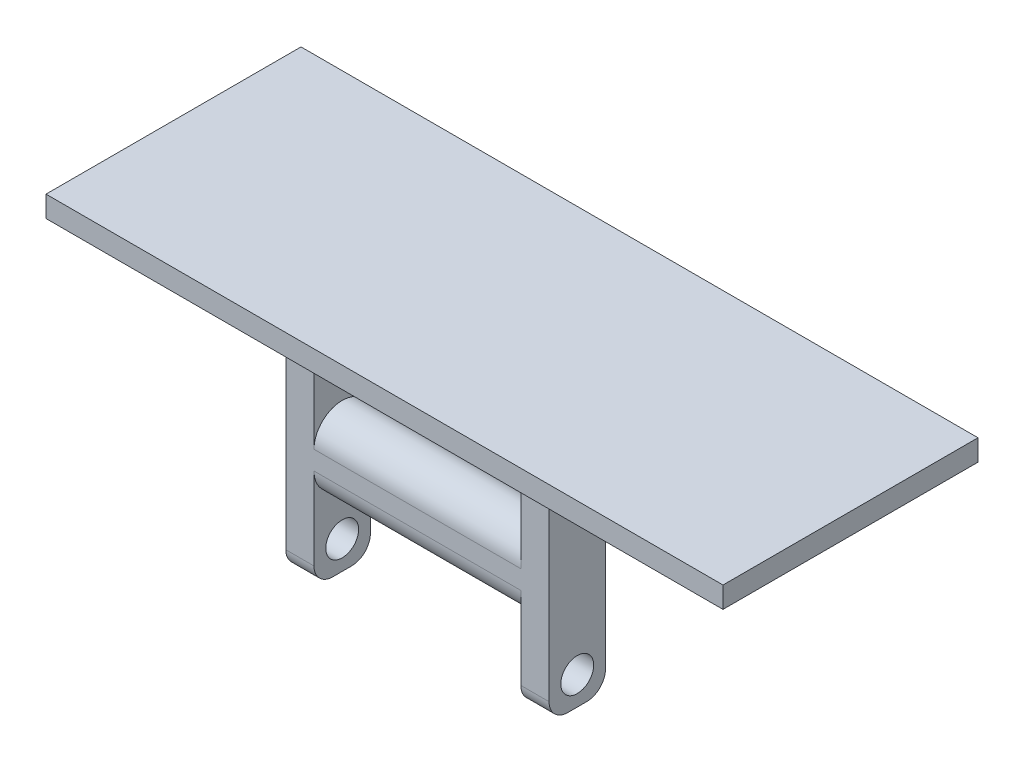
ISO-10303-21;
HEADER;
FILE_DESCRIPTION(('STEP AP214'),'2;1');
FILE_NAME('part.step','',(''),(''),'','','');
FILE_SCHEMA(('AUTOMOTIVE_DESIGN { 1 0 10303 214 1 1 1 1 }'));
ENDSEC;
DATA;
#1=APPLICATION_CONTEXT('core data for automotive mechanical design processes');
#2=APPLICATION_PROTOCOL_DEFINITION('international standard','automotive_design',2000,#1);
#3=PRODUCT_CONTEXT('',#1,'mechanical');
#4=PRODUCT('Part','Part','',(#3));
#5=PRODUCT_RELATED_PRODUCT_CATEGORY('part','',(#4));
#6=PRODUCT_DEFINITION_FORMATION('','',#4);
#7=PRODUCT_DEFINITION_CONTEXT('part definition',#1,'design');
#8=PRODUCT_DEFINITION('design','',#6,#7);
#9=PRODUCT_DEFINITION_SHAPE('','',#8);
#10=(LENGTH_UNIT() NAMED_UNIT(*) SI_UNIT(.MILLI.,.METRE.));
#11=(NAMED_UNIT(*) PLANE_ANGLE_UNIT() SI_UNIT($,.RADIAN.));
#12=(NAMED_UNIT(*) SI_UNIT($,.STERADIAN.) SOLID_ANGLE_UNIT());
#13=UNCERTAINTY_MEASURE_WITH_UNIT(LENGTH_MEASURE(1.E-05),#10,'distance_accuracy_value','');
#14=(GEOMETRIC_REPRESENTATION_CONTEXT(3) GLOBAL_UNCERTAINTY_ASSIGNED_CONTEXT((#13)) GLOBAL_UNIT_ASSIGNED_CONTEXT((#10,
#11,#12)) REPRESENTATION_CONTEXT('',''));
#15=CARTESIAN_POINT('',(0.,0.,0.));
#16=DIRECTION('',(0.,0.,1.));
#17=DIRECTION('',(1.,0.,0.));
#18=AXIS2_PLACEMENT_3D('',#15,#16,#17);
#19=CARTESIAN_POINT('',(14.,-1.,0.));
#20=DIRECTION('',(-1.,0.,0.));
#21=DIRECTION('',(0.,0.,1.));
#22=AXIS2_PLACEMENT_3D('',#19,#20,#21);
#23=CYLINDRICAL_SURFACE('',#22,3.);
#24=CARTESIAN_POINT('',(-11.,-1.,0.));
#25=DIRECTION('',(-1.,0.,0.));
#26=DIRECTION('',(0.,0.,1.));
#27=AXIS2_PLACEMENT_3D('',#24,#25,#26);
#28=CIRCLE('',#27,3.);
#29=CARTESIAN_POINT('',(-11.,-1.,-3.));
#30=VERTEX_POINT('',#29);
#31=CARTESIAN_POINT('',(-11.,-1.,3.));
#32=VERTEX_POINT('',#31);
#33=EDGE_CURVE('E249',#30,#32,#28,.T.);
#34=ORIENTED_EDGE('',*,*,#33,.F.);
#35=DIRECTION('',(-1.,0.,0.));
#36=VECTOR('',#35,1.);
#37=CARTESIAN_POINT('',(14.,-1.,-3.));
#38=LINE('',#37,#36);
#39=CARTESIAN_POINT('',(11.,-1.,-3.));
#40=VERTEX_POINT('',#39);
#41=EDGE_CURVE('E300',#40,#30,#38,.T.);
#42=ORIENTED_EDGE('',*,*,#41,.F.);
#43=CARTESIAN_POINT('',(11.,-1.,0.));
#44=DIRECTION('',(1.,0.,0.));
#45=DIRECTION('',(0.,0.,-1.));
#46=AXIS2_PLACEMENT_3D('',#43,#44,#45);
#47=CIRCLE('',#46,3.);
#48=CARTESIAN_POINT('',(11.,-1.,3.));
#49=VERTEX_POINT('',#48);
#50=EDGE_CURVE('E284',#49,#40,#47,.T.);
#51=ORIENTED_EDGE('',*,*,#50,.F.);
#52=DIRECTION('',(-1.,0.,0.));
#53=VECTOR('',#52,1.);
#54=CARTESIAN_POINT('',(14.,-1.,3.));
#55=LINE('',#54,#53);
#56=EDGE_CURVE('E292',#49,#32,#55,.T.);
#57=ORIENTED_EDGE('',*,*,#56,.T.);
#58=EDGE_LOOP('',(#34,#42,#51,#57));
#59=FACE_BOUND('',#58,.T.);
#60=ADVANCED_FACE('F33',(#59),#23,.T.);
#61=CARTESIAN_POINT('',(14.,1.,0.));
#62=DIRECTION('',(-1.,0.,0.));
#63=DIRECTION('',(0.,0.,1.));
#64=AXIS2_PLACEMENT_3D('',#61,#62,#63);
#65=CYLINDRICAL_SURFACE('',#64,3.);
#66=CARTESIAN_POINT('',(-11.,1.,0.));
#67=DIRECTION('',(-1.,0.,0.));
#68=DIRECTION('',(0.,0.,1.));
#69=AXIS2_PLACEMENT_3D('',#66,#67,#68);
#70=CIRCLE('',#69,3.);
#71=CARTESIAN_POINT('',(-11.,0.999999999999999,3.));
#72=VERTEX_POINT('',#71);
#73=CARTESIAN_POINT('',(-11.,1.,-3.));
#74=VERTEX_POINT('',#73);
#75=EDGE_CURVE('E245',#72,#74,#70,.T.);
#76=ORIENTED_EDGE('',*,*,#75,.F.);
#77=DIRECTION('',(-1.,0.,0.));
#78=VECTOR('',#77,1.);
#79=CARTESIAN_POINT('',(14.,0.999999999999999,3.));
#80=LINE('',#79,#78);
#81=CARTESIAN_POINT('',(11.,0.999999999999999,3.));
#82=VERTEX_POINT('',#81);
#83=EDGE_CURVE('E294',#82,#72,#80,.T.);
#84=ORIENTED_EDGE('',*,*,#83,.F.);
#85=CARTESIAN_POINT('',(11.,1.,0.));
#86=DIRECTION('',(1.,0.,0.));
#87=DIRECTION('',(0.,0.,-1.));
#88=AXIS2_PLACEMENT_3D('',#85,#86,#87);
#89=CIRCLE('',#88,3.);
#90=CARTESIAN_POINT('',(11.,1.,-3.));
#91=VERTEX_POINT('',#90);
#92=EDGE_CURVE('E279',#91,#82,#89,.T.);
#93=ORIENTED_EDGE('',*,*,#92,.F.);
#94=DIRECTION('',(-1.,0.,0.));
#95=VECTOR('',#94,1.);
#96=CARTESIAN_POINT('',(14.,1.,-3.));
#97=LINE('',#96,#95);
#98=EDGE_CURVE('E297',#91,#74,#97,.T.);
#99=ORIENTED_EDGE('',*,*,#98,.T.);
#100=EDGE_LOOP('',(#76,#84,#93,#99));
#101=FACE_BOUND('',#100,.T.);
#102=ADVANCED_FACE('F363',(#101),#65,.T.);
#103=CARTESIAN_POINT('',(14.,-1.,-3.));
#104=DIRECTION('',(0.,0.,1.));
#105=DIRECTION('',(0.,-1.,0.));
#106=AXIS2_PLACEMENT_3D('',#103,#104,#105);
#107=PLANE('',#106);
#108=DIRECTION('',(0.,1.,0.));
#109=VECTOR('',#108,1.);
#110=CARTESIAN_POINT('',(-14.,-1.,-3.));
#111=LINE('',#110,#109);
#112=CARTESIAN_POINT('',(-14.,-9.75,-3.));
#113=VERTEX_POINT('',#112);
#114=CARTESIAN_POINT('',(-14.,11.5,-3.));
#115=VERTEX_POINT('',#114);
#116=EDGE_CURVE('E254',#113,#115,#111,.T.);
#117=ORIENTED_EDGE('',*,*,#116,.T.);
#118=DIRECTION('',(1.,0.,0.));
#119=VECTOR('',#118,1.);
#120=CARTESIAN_POINT('',(14.,11.5,-3.));
#121=LINE('',#120,#119);
#122=CARTESIAN_POINT('',(-11.,11.5,-3.));
#123=VERTEX_POINT('',#122);
#124=EDGE_CURVE('E213',#115,#123,#121,.T.);
#125=ORIENTED_EDGE('',*,*,#124,.T.);
#126=DIRECTION('',(0.,1.,0.));
#127=VECTOR('',#126,1.);
#128=CARTESIAN_POINT('',(-11.,11.75,-3.));
#129=LINE('',#128,#127);
#130=EDGE_CURVE('E239',#74,#123,#129,.T.);
#131=ORIENTED_EDGE('',*,*,#130,.F.);
#132=ORIENTED_EDGE('',*,*,#98,.F.);
#133=DIRECTION('',(0.,1.,0.));
#134=VECTOR('',#133,1.);
#135=CARTESIAN_POINT('',(11.,11.75,-3.));
#136=LINE('',#135,#134);
#137=CARTESIAN_POINT('',(11.,11.5,-3.));
#138=VERTEX_POINT('',#137);
#139=EDGE_CURVE('E273',#91,#138,#136,.T.);
#140=ORIENTED_EDGE('',*,*,#139,.T.);
#141=CARTESIAN_POINT('',(14.,11.5,-3.));
#142=VERTEX_POINT('',#141);
#143=EDGE_CURVE('E48',#138,#142,#121,.T.);
#144=ORIENTED_EDGE('',*,*,#143,.T.);
#145=DIRECTION('',(0.,1.,0.));
#146=VECTOR('',#145,1.);
#147=CARTESIAN_POINT('',(14.,-1.,-3.));
#148=LINE('',#147,#146);
#149=CARTESIAN_POINT('',(14.,-9.75,-3.));
#150=VERTEX_POINT('',#149);
#151=EDGE_CURVE('E287',#150,#142,#148,.T.);
#152=ORIENTED_EDGE('',*,*,#151,.F.);
#153=DIRECTION('',(1.,0.,0.));
#154=VECTOR('',#153,1.);
#155=CARTESIAN_POINT('',(11.,-9.75,-3.));
#156=LINE('',#155,#154);
#157=CARTESIAN_POINT('',(11.,-9.75,-3.));
#158=VERTEX_POINT('',#157);
#159=EDGE_CURVE('E319',#150,#158,#156,.F.);
#160=ORIENTED_EDGE('',*,*,#159,.T.);
#161=EDGE_CURVE('E270',#158,#40,#136,.T.);
#162=ORIENTED_EDGE('',*,*,#161,.T.);
#163=ORIENTED_EDGE('',*,*,#41,.T.);
#164=CARTESIAN_POINT('',(-11.,-9.75,-3.));
#165=VERTEX_POINT('',#164);
#166=EDGE_CURVE('E236',#165,#30,#129,.T.);
#167=ORIENTED_EDGE('',*,*,#166,.F.);
#168=DIRECTION('',(-1.,0.,0.));
#169=VECTOR('',#168,1.);
#170=CARTESIAN_POINT('',(14.,-9.75,-3.));
#171=LINE('',#170,#169);
#172=EDGE_CURVE('E41',#165,#113,#171,.T.);
#173=ORIENTED_EDGE('',*,*,#172,.T.);
#174=EDGE_LOOP('',(#117,#125,#131,#132,#140,#144,#152,#160,#162,#163,#167,#173));
#175=FACE_BOUND('',#174,.T.);
#176=ADVANCED_FACE('F341',(#175),#107,.F.);
#177=CARTESIAN_POINT('',(14.,-1.,3.));
#178=DIRECTION('',(0.,0.,-1.));
#179=DIRECTION('',(0.,1.,0.));
#180=AXIS2_PLACEMENT_3D('',#177,#178,#179);
#181=PLANE('',#180);
#182=DIRECTION('',(0.,-1.,0.));
#183=VECTOR('',#182,1.);
#184=CARTESIAN_POINT('',(14.,-1.,3.));
#185=LINE('',#184,#183);
#186=CARTESIAN_POINT('',(14.,11.5,3.));
#187=VERTEX_POINT('',#186);
#188=CARTESIAN_POINT('',(14.,-9.75,3.));
#189=VERTEX_POINT('',#188);
#190=EDGE_CURVE('E290',#187,#189,#185,.T.);
#191=ORIENTED_EDGE('',*,*,#190,.F.);
#192=DIRECTION('',(-1.,0.,0.));
#193=VECTOR('',#192,1.);
#194=CARTESIAN_POINT('',(14.,11.5,3.));
#195=LINE('',#194,#193);
#196=CARTESIAN_POINT('',(11.,11.5,3.));
#197=VERTEX_POINT('',#196);
#198=EDGE_CURVE('E214',#187,#197,#195,.T.);
#199=ORIENTED_EDGE('',*,*,#198,.T.);
#200=DIRECTION('',(0.,-1.,0.));
#201=VECTOR('',#200,1.);
#202=CARTESIAN_POINT('',(11.,11.75,3.));
#203=LINE('',#202,#201);
#204=EDGE_CURVE('E274',#197,#82,#203,.T.);
#205=ORIENTED_EDGE('',*,*,#204,.T.);
#206=ORIENTED_EDGE('',*,*,#83,.T.);
#207=DIRECTION('',(0.,-1.,0.));
#208=VECTOR('',#207,1.);
#209=CARTESIAN_POINT('',(-11.,11.75,3.));
#210=LINE('',#209,#208);
#211=CARTESIAN_POINT('',(-11.,11.5,3.));
#212=VERTEX_POINT('',#211);
#213=EDGE_CURVE('E243',#212,#72,#210,.T.);
#214=ORIENTED_EDGE('',*,*,#213,.F.);
#215=CARTESIAN_POINT('',(-14.,11.5,3.));
#216=VERTEX_POINT('',#215);
#217=EDGE_CURVE('E56',#212,#216,#195,.T.);
#218=ORIENTED_EDGE('',*,*,#217,.T.);
#219=DIRECTION('',(0.,-1.,0.));
#220=VECTOR('',#219,1.);
#221=CARTESIAN_POINT('',(-14.,-1.,3.));
#222=LINE('',#221,#220);
#223=CARTESIAN_POINT('',(-14.,-9.75,3.));
#224=VERTEX_POINT('',#223);
#225=EDGE_CURVE('E252',#216,#224,#222,.T.);
#226=ORIENTED_EDGE('',*,*,#225,.T.);
#227=DIRECTION('',(-1.,0.,0.));
#228=VECTOR('',#227,1.);
#229=CARTESIAN_POINT('',(14.,-9.75,3.));
#230=LINE('',#229,#228);
#231=CARTESIAN_POINT('',(-11.,-9.75,3.));
#232=VERTEX_POINT('',#231);
#233=EDGE_CURVE('E331',#224,#232,#230,.F.);
#234=ORIENTED_EDGE('',*,*,#233,.T.);
#235=EDGE_CURVE('E242',#32,#232,#210,.T.);
#236=ORIENTED_EDGE('',*,*,#235,.F.);
#237=ORIENTED_EDGE('',*,*,#56,.F.);
#238=CARTESIAN_POINT('',(11.,-9.75,3.));
#239=VERTEX_POINT('',#238);
#240=EDGE_CURVE('E272',#49,#239,#203,.T.);
#241=ORIENTED_EDGE('',*,*,#240,.T.);
#242=DIRECTION('',(1.,0.,0.));
#243=VECTOR('',#242,1.);
#244=CARTESIAN_POINT('',(14.,-9.75,3.));
#245=LINE('',#244,#243);
#246=EDGE_CURVE('E303',#239,#189,#245,.T.);
#247=ORIENTED_EDGE('',*,*,#246,.T.);
#248=EDGE_LOOP('',(#191,#199,#205,#206,#214,#218,#226,#234,#236,#237,#241,#247));
#249=FACE_BOUND('',#248,.T.);
#250=ADVANCED_FACE('F355',(#249),#181,.F.);
#251=CARTESIAN_POINT('',(14.,-1.,0.));
#252=DIRECTION('',(1.,0.,0.));
#253=DIRECTION('',(0.,0.,-1.));
#254=AXIS2_PLACEMENT_3D('',#251,#252,#253);
#255=PLANE('',#254);
#256=DIRECTION('',(0.,0.,-1.));
#257=VECTOR('',#256,1.);
#258=CARTESIAN_POINT('',(14.,11.5,0.));
#259=LINE('',#258,#257);
#260=EDGE_CURVE('E221',#187,#142,#259,.T.);
#261=ORIENTED_EDGE('',*,*,#260,.F.);
#262=ORIENTED_EDGE('',*,*,#190,.T.);
#263=CARTESIAN_POINT('',(14.,-9.75,0.999999999999999));
#264=DIRECTION('',(1.,0.,0.));
#265=DIRECTION('',(0.,0.,-1.));
#266=AXIS2_PLACEMENT_3D('',#263,#264,#265);
#267=CIRCLE('',#266,2.);
#268=CARTESIAN_POINT('',(14.,-11.75,0.999999999999999));
#269=VERTEX_POINT('',#268);
#270=EDGE_CURVE('E308',#189,#269,#267,.T.);
#271=ORIENTED_EDGE('',*,*,#270,.T.);
#272=DIRECTION('',(0.,0.,-1.));
#273=VECTOR('',#272,1.);
#274=CARTESIAN_POINT('',(14.,-11.75,3.));
#275=LINE('',#274,#273);
#276=CARTESIAN_POINT('',(14.,-11.75,-1.));
#277=VERTEX_POINT('',#276);
#278=EDGE_CURVE('E267',#269,#277,#275,.T.);
#279=ORIENTED_EDGE('',*,*,#278,.T.);
#280=CARTESIAN_POINT('',(14.,-9.75,-1.));
#281=DIRECTION('',(1.,0.,0.));
#282=DIRECTION('',(0.,0.,-1.));
#283=AXIS2_PLACEMENT_3D('',#280,#281,#282);
#284=CIRCLE('',#283,2.);
#285=EDGE_CURVE('E306',#277,#150,#284,.T.);
#286=ORIENTED_EDGE('',*,*,#285,.T.);
#287=ORIENTED_EDGE('',*,*,#151,.T.);
#288=EDGE_LOOP('',(#261,#262,#271,#279,#286,#287));
#289=FACE_BOUND('',#288,.T.);
#290=CARTESIAN_POINT('',(14.,8.75,0.));
#291=DIRECTION('',(1.,0.,0.));
#292=DIRECTION('',(0.,0.,-1.));
#293=AXIS2_PLACEMENT_3D('',#290,#291,#292);
#294=CIRCLE('',#293,1.75);
#295=CARTESIAN_POINT('',(14.,8.75,-1.75));
#296=VERTEX_POINT('',#295);
#297=EDGE_CURVE('E257',#296,#296,#294,.T.);
#298=ORIENTED_EDGE('',*,*,#297,.F.);
#299=EDGE_LOOP('',(#298));
#300=FACE_BOUND('',#299,.T.);
#301=CARTESIAN_POINT('',(14.,-8.75,0.));
#302=DIRECTION('',(1.,0.,0.));
#303=DIRECTION('',(0.,0.,-1.));
#304=AXIS2_PLACEMENT_3D('',#301,#302,#303);
#305=CIRCLE('',#304,1.75);
#306=CARTESIAN_POINT('',(14.,-8.75,-1.75));
#307=VERTEX_POINT('',#306);
#308=EDGE_CURVE('E261',#307,#307,#305,.T.);
#309=ORIENTED_EDGE('',*,*,#308,.F.);
#310=EDGE_LOOP('',(#309));
#311=FACE_BOUND('',#310,.T.);
#312=ADVANCED_FACE('F377',(#289,#300,#311),#255,.T.);
#313=CARTESIAN_POINT('',(11.,8.75,0.));
#314=DIRECTION('',(1.,0.,0.));
#315=DIRECTION('',(0.,0.,-1.));
#316=AXIS2_PLACEMENT_3D('',#313,#314,#315);
#317=CYLINDRICAL_SURFACE('',#316,1.75);
#318=CARTESIAN_POINT('',(11.,8.75,0.));
#319=DIRECTION('',(1.,0.,0.));
#320=DIRECTION('',(0.,0.,-1.));
#321=AXIS2_PLACEMENT_3D('',#318,#319,#320);
#322=CIRCLE('',#321,1.75);
#323=CARTESIAN_POINT('',(11.,8.75,-1.75));
#324=VERTEX_POINT('',#323);
#325=EDGE_CURVE('E258',#324,#324,#322,.T.);
#326=ORIENTED_EDGE('',*,*,#325,.F.);
#327=EDGE_LOOP('',(#326));
#328=FACE_BOUND('',#327,.T.);
#329=ORIENTED_EDGE('',*,*,#297,.T.);
#330=EDGE_LOOP('',(#329));
#331=FACE_BOUND('',#330,.T.);
#332=ADVANCED_FACE('F445',(#328,#331),#317,.F.);
#333=CARTESIAN_POINT('',(11.,0.,0.));
#334=DIRECTION('',(1.,0.,0.));
#335=DIRECTION('',(0.,0.,-1.));
#336=AXIS2_PLACEMENT_3D('',#333,#334,#335);
#337=PLANE('',#336);
#338=ORIENTED_EDGE('',*,*,#325,.T.);
#339=EDGE_LOOP('',(#338));
#340=FACE_BOUND('',#339,.T.);
#341=ORIENTED_EDGE('',*,*,#204,.F.);
#342=DIRECTION('',(0.,0.,-1.));
#343=VECTOR('',#342,1.);
#344=CARTESIAN_POINT('',(11.,11.5,0.));
#345=LINE('',#344,#343);
#346=EDGE_CURVE('E219',#197,#138,#345,.T.);
#347=ORIENTED_EDGE('',*,*,#346,.T.);
#348=ORIENTED_EDGE('',*,*,#139,.F.);
#349=ORIENTED_EDGE('',*,*,#92,.T.);
#350=EDGE_LOOP('',(#341,#347,#348,#349));
#351=FACE_BOUND('',#350,.T.);
#352=ADVANCED_FACE('F370',(#340,#351),#337,.F.);
#353=CARTESIAN_POINT('',(11.,-8.75,0.));
#354=DIRECTION('',(1.,0.,0.));
#355=DIRECTION('',(0.,0.,-1.));
#356=AXIS2_PLACEMENT_3D('',#353,#354,#355);
#357=CIRCLE('',#356,1.75);
#358=CARTESIAN_POINT('',(11.,-8.75,-1.75));
#359=VERTEX_POINT('',#358);
#360=EDGE_CURVE('E264',#359,#359,#357,.T.);
#361=ORIENTED_EDGE('',*,*,#360,.T.);
#362=EDGE_LOOP('',(#361));
#363=FACE_BOUND('',#362,.T.);
#364=DIRECTION('',(0.,0.,-1.));
#365=VECTOR('',#364,1.);
#366=CARTESIAN_POINT('',(11.,-11.75,3.));
#367=LINE('',#366,#365);
#368=CARTESIAN_POINT('',(11.,-11.75,0.999999999999999));
#369=VERTEX_POINT('',#368);
#370=CARTESIAN_POINT('',(11.,-11.75,-1.));
#371=VERTEX_POINT('',#370);
#372=EDGE_CURVE('E276',#369,#371,#367,.T.);
#373=ORIENTED_EDGE('',*,*,#372,.F.);
#374=CARTESIAN_POINT('',(11.,-9.75,0.999999999999999));
#375=DIRECTION('',(1.,0.,0.));
#376=DIRECTION('',(0.,0.,-1.));
#377=AXIS2_PLACEMENT_3D('',#374,#375,#376);
#378=CIRCLE('',#377,2.);
#379=EDGE_CURVE('E317',#369,#239,#378,.F.);
#380=ORIENTED_EDGE('',*,*,#379,.T.);
#381=ORIENTED_EDGE('',*,*,#240,.F.);
#382=ORIENTED_EDGE('',*,*,#50,.T.);
#383=ORIENTED_EDGE('',*,*,#161,.F.);
#384=CARTESIAN_POINT('',(11.,-9.75,-1.));
#385=DIRECTION('',(1.,0.,0.));
#386=DIRECTION('',(0.,0.,-1.));
#387=AXIS2_PLACEMENT_3D('',#384,#385,#386);
#388=CIRCLE('',#387,2.);
#389=EDGE_CURVE('E315',#158,#371,#388,.F.);
#390=ORIENTED_EDGE('',*,*,#389,.T.);
#391=EDGE_LOOP('',(#373,#380,#381,#382,#383,#390));
#392=FACE_BOUND('',#391,.T.);
#393=ADVANCED_FACE('F389',(#363,#392),#337,.F.);
#394=CARTESIAN_POINT('',(11.,-11.75,3.));
#395=DIRECTION('',(0.,-1.,0.));
#396=DIRECTION('',(0.,0.,-1.));
#397=AXIS2_PLACEMENT_3D('',#394,#395,#396);
#398=PLANE('',#397);
#399=ORIENTED_EDGE('',*,*,#278,.F.);
#400=DIRECTION('',(1.,0.,0.));
#401=VECTOR('',#400,1.);
#402=CARTESIAN_POINT('',(11.,-11.75,0.999999999999999));
#403=LINE('',#402,#401);
#404=EDGE_CURVE('E313',#269,#369,#403,.F.);
#405=ORIENTED_EDGE('',*,*,#404,.T.);
#406=ORIENTED_EDGE('',*,*,#372,.T.);
#407=DIRECTION('',(1.,0.,0.));
#408=VECTOR('',#407,1.);
#409=CARTESIAN_POINT('',(14.,-11.75,-1.));
#410=LINE('',#409,#408);
#411=EDGE_CURVE('E310',#371,#277,#410,.T.);
#412=ORIENTED_EDGE('',*,*,#411,.T.);
#413=EDGE_LOOP('',(#399,#405,#406,#412));
#414=FACE_BOUND('',#413,.T.);
#415=ADVANCED_FACE('F386',(#414),#398,.T.);
#416=CARTESIAN_POINT('',(11.,-8.75,0.));
#417=DIRECTION('',(1.,0.,0.));
#418=DIRECTION('',(0.,0.,-1.));
#419=AXIS2_PLACEMENT_3D('',#416,#417,#418);
#420=CYLINDRICAL_SURFACE('',#419,1.75);
#421=ORIENTED_EDGE('',*,*,#360,.F.);
#422=EDGE_LOOP('',(#421));
#423=FACE_BOUND('',#422,.T.);
#424=ORIENTED_EDGE('',*,*,#308,.T.);
#425=EDGE_LOOP('',(#424));
#426=FACE_BOUND('',#425,.T.);
#427=ADVANCED_FACE('F430',(#423,#426),#420,.F.);
#428=CARTESIAN_POINT('',(14.,-9.75,0.999999999999999));
#429=DIRECTION('',(-1.,0.,0.));
#430=DIRECTION('',(0.,0.,1.));
#431=AXIS2_PLACEMENT_3D('',#428,#429,#430);
#432=CYLINDRICAL_SURFACE('',#431,2.);
#433=ORIENTED_EDGE('',*,*,#379,.F.);
#434=ORIENTED_EDGE('',*,*,#404,.F.);
#435=ORIENTED_EDGE('',*,*,#270,.F.);
#436=ORIENTED_EDGE('',*,*,#246,.F.);
#437=EDGE_LOOP('',(#433,#434,#435,#436));
#438=FACE_BOUND('',#437,.T.);
#439=ADVANCED_FACE('F383',(#438),#432,.T.);
#440=CARTESIAN_POINT('',(11.,-9.75,-1.));
#441=DIRECTION('',(-1.,0.,0.));
#442=DIRECTION('',(0.,0.,1.));
#443=AXIS2_PLACEMENT_3D('',#440,#441,#442);
#444=CYLINDRICAL_SURFACE('',#443,2.);
#445=ORIENTED_EDGE('',*,*,#389,.F.);
#446=ORIENTED_EDGE('',*,*,#159,.F.);
#447=ORIENTED_EDGE('',*,*,#285,.F.);
#448=ORIENTED_EDGE('',*,*,#411,.F.);
#449=EDGE_LOOP('',(#445,#446,#447,#448));
#450=FACE_BOUND('',#449,.T.);
#451=ADVANCED_FACE('F394',(#450),#444,.T.);
#452=CARTESIAN_POINT('',(-14.,-1.,0.));
#453=DIRECTION('',(-1.,0.,0.));
#454=DIRECTION('',(0.,0.,-1.));
#455=AXIS2_PLACEMENT_3D('',#452,#453,#454);
#456=PLANE('',#455);
#457=DIRECTION('',(0.,0.,1.));
#458=VECTOR('',#457,1.);
#459=CARTESIAN_POINT('',(-14.,11.5,0.));
#460=LINE('',#459,#458);
#461=EDGE_CURVE('E217',#115,#216,#460,.T.);
#462=ORIENTED_EDGE('',*,*,#461,.F.);
#463=ORIENTED_EDGE('',*,*,#116,.F.);
#464=CARTESIAN_POINT('',(-14.,-9.75,-1.));
#465=DIRECTION('',(-1.,0.,0.));
#466=DIRECTION('',(0.,0.,1.));
#467=AXIS2_PLACEMENT_3D('',#464,#465,#466);
#468=CIRCLE('',#467,2.);
#469=CARTESIAN_POINT('',(-14.,-11.75,-1.));
#470=VERTEX_POINT('',#469);
#471=EDGE_CURVE('E326',#113,#470,#468,.T.);
#472=ORIENTED_EDGE('',*,*,#471,.T.);
#473=DIRECTION('',(0.,0.,-1.));
#474=VECTOR('',#473,1.);
#475=CARTESIAN_POINT('',(-14.,-11.75,3.));
#476=LINE('',#475,#474);
#477=CARTESIAN_POINT('',(-14.,-11.75,0.999999999999999));
#478=VERTEX_POINT('',#477);
#479=EDGE_CURVE('E233',#478,#470,#476,.T.);
#480=ORIENTED_EDGE('',*,*,#479,.F.);
#481=CARTESIAN_POINT('',(-14.,-9.75,0.999999999999999));
#482=DIRECTION('',(-1.,0.,0.));
#483=DIRECTION('',(0.,0.,1.));
#484=AXIS2_PLACEMENT_3D('',#481,#482,#483);
#485=CIRCLE('',#484,2.);
#486=EDGE_CURVE('E328',#478,#224,#485,.T.);
#487=ORIENTED_EDGE('',*,*,#486,.T.);
#488=ORIENTED_EDGE('',*,*,#225,.F.);
#489=EDGE_LOOP('',(#462,#463,#472,#480,#487,#488));
#490=FACE_BOUND('',#489,.T.);
#491=CARTESIAN_POINT('',(-14.,8.75,0.));
#492=DIRECTION('',(1.,0.,0.));
#493=DIRECTION('',(0.,0.,-1.));
#494=AXIS2_PLACEMENT_3D('',#491,#492,#493);
#495=CIRCLE('',#494,1.75);
#496=CARTESIAN_POINT('',(-14.,8.75,-1.75));
#497=VERTEX_POINT('',#496);
#498=EDGE_CURVE('E223',#497,#497,#495,.T.);
#499=ORIENTED_EDGE('',*,*,#498,.T.);
#500=EDGE_LOOP('',(#499));
#501=FACE_BOUND('',#500,.T.);
#502=CARTESIAN_POINT('',(-14.,-8.75,0.));
#503=DIRECTION('',(1.,0.,0.));
#504=DIRECTION('',(0.,0.,-1.));
#505=AXIS2_PLACEMENT_3D('',#502,#503,#504);
#506=CIRCLE('',#505,1.75);
#507=CARTESIAN_POINT('',(-14.,-8.75,-1.75));
#508=VERTEX_POINT('',#507);
#509=EDGE_CURVE('E227',#508,#508,#506,.T.);
#510=ORIENTED_EDGE('',*,*,#509,.T.);
#511=EDGE_LOOP('',(#510));
#512=FACE_BOUND('',#511,.T.);
#513=ADVANCED_FACE('F346',(#490,#501,#512),#456,.T.);
#514=CARTESIAN_POINT('',(-11.,8.75,0.));
#515=DIRECTION('',(-1.,0.,0.));
#516=DIRECTION('',(0.,0.,1.));
#517=AXIS2_PLACEMENT_3D('',#514,#515,#516);
#518=CYLINDRICAL_SURFACE('',#517,1.75);
#519=CARTESIAN_POINT('',(-11.,8.75,0.));
#520=DIRECTION('',(1.,0.,0.));
#521=DIRECTION('',(0.,0.,-1.));
#522=AXIS2_PLACEMENT_3D('',#519,#520,#521);
#523=CIRCLE('',#522,1.75);
#524=CARTESIAN_POINT('',(-11.,8.75,-1.75));
#525=VERTEX_POINT('',#524);
#526=EDGE_CURVE('E224',#525,#525,#523,.T.);
#527=ORIENTED_EDGE('',*,*,#526,.T.);
#528=EDGE_LOOP('',(#527));
#529=FACE_BOUND('',#528,.T.);
#530=ORIENTED_EDGE('',*,*,#498,.F.);
#531=EDGE_LOOP('',(#530));
#532=FACE_BOUND('',#531,.T.);
#533=ADVANCED_FACE('F435',(#529,#532),#518,.F.);
#534=CARTESIAN_POINT('',(-11.,0.,0.));
#535=DIRECTION('',(-1.,0.,0.));
#536=DIRECTION('',(0.,0.,-1.));
#537=AXIS2_PLACEMENT_3D('',#534,#535,#536);
#538=PLANE('',#537);
#539=ORIENTED_EDGE('',*,*,#526,.F.);
#540=EDGE_LOOP('',(#539));
#541=FACE_BOUND('',#540,.T.);
#542=ORIENTED_EDGE('',*,*,#130,.T.);
#543=DIRECTION('',(0.,0.,1.));
#544=VECTOR('',#543,1.);
#545=CARTESIAN_POINT('',(-11.,11.5,0.));
#546=LINE('',#545,#544);
#547=EDGE_CURVE('E11',#123,#212,#546,.T.);
#548=ORIENTED_EDGE('',*,*,#547,.T.);
#549=ORIENTED_EDGE('',*,*,#213,.T.);
#550=ORIENTED_EDGE('',*,*,#75,.T.);
#551=EDGE_LOOP('',(#542,#548,#549,#550));
#552=FACE_BOUND('',#551,.T.);
#553=ADVANCED_FACE('F360',(#541,#552),#538,.F.);
#554=CARTESIAN_POINT('',(-11.,-8.75,0.));
#555=DIRECTION('',(1.,0.,0.));
#556=DIRECTION('',(0.,0.,-1.));
#557=AXIS2_PLACEMENT_3D('',#554,#555,#556);
#558=CIRCLE('',#557,1.75);
#559=CARTESIAN_POINT('',(-11.,-8.75,-1.75));
#560=VERTEX_POINT('',#559);
#561=EDGE_CURVE('E230',#560,#560,#558,.T.);
#562=ORIENTED_EDGE('',*,*,#561,.F.);
#563=EDGE_LOOP('',(#562));
#564=FACE_BOUND('',#563,.T.);
#565=ORIENTED_EDGE('',*,*,#235,.T.);
#566=CARTESIAN_POINT('',(-11.,-9.75,0.999999999999999));
#567=DIRECTION('',(-1.,0.,0.));
#568=DIRECTION('',(0.,0.,1.));
#569=AXIS2_PLACEMENT_3D('',#566,#567,#568);
#570=CIRCLE('',#569,2.);
#571=CARTESIAN_POINT('',(-11.,-11.75,0.999999999999999));
#572=VERTEX_POINT('',#571);
#573=EDGE_CURVE('E335',#232,#572,#570,.F.);
#574=ORIENTED_EDGE('',*,*,#573,.T.);
#575=DIRECTION('',(0.,0.,-1.));
#576=VECTOR('',#575,1.);
#577=CARTESIAN_POINT('',(-11.,-11.75,3.));
#578=LINE('',#577,#576);
#579=CARTESIAN_POINT('',(-11.,-11.75,-1.));
#580=VERTEX_POINT('',#579);
#581=EDGE_CURVE('E238',#572,#580,#578,.T.);
#582=ORIENTED_EDGE('',*,*,#581,.T.);
#583=CARTESIAN_POINT('',(-11.,-9.75,-1.));
#584=DIRECTION('',(-1.,0.,0.));
#585=DIRECTION('',(0.,0.,1.));
#586=AXIS2_PLACEMENT_3D('',#583,#584,#585);
#587=CIRCLE('',#586,2.);
#588=EDGE_CURVE('E333',#580,#165,#587,.F.);
#589=ORIENTED_EDGE('',*,*,#588,.T.);
#590=ORIENTED_EDGE('',*,*,#166,.T.);
#591=ORIENTED_EDGE('',*,*,#33,.T.);
#592=EDGE_LOOP('',(#565,#574,#582,#589,#590,#591));
#593=FACE_BOUND('',#592,.T.);
#594=ADVANCED_FACE('F403',(#564,#593),#538,.F.);
#595=CARTESIAN_POINT('',(-11.,-11.75,3.));
#596=DIRECTION('',(0.,1.,0.));
#597=DIRECTION('',(0.,0.,1.));
#598=AXIS2_PLACEMENT_3D('',#595,#596,#597);
#599=PLANE('',#598);
#600=ORIENTED_EDGE('',*,*,#581,.F.);
#601=DIRECTION('',(-1.,0.,0.));
#602=VECTOR('',#601,1.);
#603=CARTESIAN_POINT('',(-11.,-11.75,0.999999999999999));
#604=LINE('',#603,#602);
#605=EDGE_CURVE('E323',#572,#478,#604,.T.);
#606=ORIENTED_EDGE('',*,*,#605,.T.);
#607=ORIENTED_EDGE('',*,*,#479,.T.);
#608=DIRECTION('',(-1.,0.,0.));
#609=VECTOR('',#608,1.);
#610=CARTESIAN_POINT('',(-11.,-11.75,-1.));
#611=LINE('',#610,#609);
#612=EDGE_CURVE('E321',#470,#580,#611,.F.);
#613=ORIENTED_EDGE('',*,*,#612,.T.);
#614=EDGE_LOOP('',(#600,#606,#607,#613));
#615=FACE_BOUND('',#614,.T.);
#616=ADVANCED_FACE('F411',(#615),#599,.F.);
#617=CARTESIAN_POINT('',(-11.,-8.75,0.));
#618=DIRECTION('',(-1.,0.,0.));
#619=DIRECTION('',(0.,0.,1.));
#620=AXIS2_PLACEMENT_3D('',#617,#618,#619);
#621=CYLINDRICAL_SURFACE('',#620,1.75);
#622=ORIENTED_EDGE('',*,*,#561,.T.);
#623=EDGE_LOOP('',(#622));
#624=FACE_BOUND('',#623,.T.);
#625=ORIENTED_EDGE('',*,*,#509,.F.);
#626=EDGE_LOOP('',(#625));
#627=FACE_BOUND('',#626,.T.);
#628=ADVANCED_FACE('F419',(#624,#627),#621,.F.);
#629=CARTESIAN_POINT('',(-11.,-9.75,0.999999999999999));
#630=DIRECTION('',(-1.,0.,0.));
#631=DIRECTION('',(0.,0.,1.));
#632=AXIS2_PLACEMENT_3D('',#629,#630,#631);
#633=CYLINDRICAL_SURFACE('',#632,2.);
#634=ORIENTED_EDGE('',*,*,#573,.F.);
#635=ORIENTED_EDGE('',*,*,#233,.F.);
#636=ORIENTED_EDGE('',*,*,#486,.F.);
#637=ORIENTED_EDGE('',*,*,#605,.F.);
#638=EDGE_LOOP('',(#634,#635,#636,#637));
#639=FACE_BOUND('',#638,.T.);
#640=ADVANCED_FACE('F407',(#639),#633,.T.);
#641=CARTESIAN_POINT('',(14.,-9.75,-1.));
#642=DIRECTION('',(-1.,0.,0.));
#643=DIRECTION('',(0.,0.,1.));
#644=AXIS2_PLACEMENT_3D('',#641,#642,#643);
#645=CYLINDRICAL_SURFACE('',#644,2.);
#646=ORIENTED_EDGE('',*,*,#588,.F.);
#647=ORIENTED_EDGE('',*,*,#612,.F.);
#648=ORIENTED_EDGE('',*,*,#471,.F.);
#649=ORIENTED_EDGE('',*,*,#172,.F.);
#650=EDGE_LOOP('',(#646,#647,#648,#649));
#651=FACE_BOUND('',#650,.T.);
#652=ADVANCED_FACE('F35',(#651),#645,.T.);
#653=CARTESIAN_POINT('',(-36.,11.5,6.49999999999999));
#654=DIRECTION('',(0.,-1.,0.));
#655=DIRECTION('',(1.,0.,0.));
#656=AXIS2_PLACEMENT_3D('',#653,#654,#655);
#657=PLANE('',#656);
#658=ORIENTED_EDGE('',*,*,#198,.F.);
#659=ORIENTED_EDGE('',*,*,#260,.T.);
#660=ORIENTED_EDGE('',*,*,#143,.F.);
#661=ORIENTED_EDGE('',*,*,#346,.F.);
#662=EDGE_LOOP('',(#658,#659,#660,#661));
#663=FACE_BOUND('',#662,.T.);
#664=ORIENTED_EDGE('',*,*,#124,.F.);
#665=ORIENTED_EDGE('',*,*,#461,.T.);
#666=ORIENTED_EDGE('',*,*,#217,.F.);
#667=ORIENTED_EDGE('',*,*,#547,.F.);
#668=EDGE_LOOP('',(#664,#665,#666,#667));
#669=FACE_BOUND('',#668,.T.);
#670=DIRECTION('',(0.,0.,1.));
#671=VECTOR('',#670,1.);
#672=CARTESIAN_POINT('',(-36.,11.5,6.49999999999999));
#673=LINE('',#672,#671);
#674=CARTESIAN_POINT('',(-36.,11.5,-20.6198957893482));
#675=VERTEX_POINT('',#674);
#676=CARTESIAN_POINT('',(-36.,11.5,6.49999999999999));
#677=VERTEX_POINT('',#676);
#678=EDGE_CURVE('E176',#675,#677,#673,.T.);
#679=ORIENTED_EDGE('',*,*,#678,.F.);
#680=DIRECTION('',(-1.,0.,0.));
#681=VECTOR('',#680,1.);
#682=CARTESIAN_POINT('',(-36.,11.5,-20.6198957893482));
#683=LINE('',#682,#681);
#684=CARTESIAN_POINT('',(36.,11.5,-20.6198957893482));
#685=VERTEX_POINT('',#684);
#686=EDGE_CURVE('E202',#685,#675,#683,.T.);
#687=ORIENTED_EDGE('',*,*,#686,.F.);
#688=DIRECTION('',(0.,0.,-1.));
#689=VECTOR('',#688,1.);
#690=CARTESIAN_POINT('',(36.,11.5,6.49999999999999));
#691=LINE('',#690,#689);
#692=CARTESIAN_POINT('',(36.,11.5,6.49999999999999));
#693=VERTEX_POINT('',#692);
#694=EDGE_CURVE('E206',#693,#685,#691,.T.);
#695=ORIENTED_EDGE('',*,*,#694,.F.);
#696=DIRECTION('',(1.,0.,0.));
#697=VECTOR('',#696,1.);
#698=CARTESIAN_POINT('',(-36.,11.5,6.49999999999999));
#699=LINE('',#698,#697);
#700=EDGE_CURVE('E198',#677,#693,#699,.T.);
#701=ORIENTED_EDGE('',*,*,#700,.F.);
#702=EDGE_LOOP('',(#679,#687,#695,#701));
#703=FACE_BOUND('',#702,.T.);
#704=ADVANCED_FACE('F350',(#663,#669,#703),#657,.T.);
#705=CARTESIAN_POINT('',(-36.,-65.4382138317826,6.49999999999999));
#706=DIRECTION('',(0.,0.,1.));
#707=DIRECTION('',(1.,0.,0.));
#708=AXIS2_PLACEMENT_3D('',#705,#706,#707);
#709=PLANE('',#708);
#710=DIRECTION('',(0.,1.,0.));
#711=VECTOR('',#710,1.);
#712=CARTESIAN_POINT('',(-36.,-65.4382138317826,6.49999999999999));
#713=LINE('',#712,#711);
#714=CARTESIAN_POINT('',(-36.,13.75,6.49999999999999));
#715=VERTEX_POINT('',#714);
#716=EDGE_CURVE('E170',#677,#715,#713,.T.);
#717=ORIENTED_EDGE('',*,*,#716,.F.);
#718=ORIENTED_EDGE('',*,*,#700,.T.);
#719=DIRECTION('',(0.,1.,0.));
#720=VECTOR('',#719,1.);
#721=CARTESIAN_POINT('',(36.,-65.4382138317826,6.49999999999999));
#722=LINE('',#721,#720);
#723=CARTESIAN_POINT('',(36.,13.75,6.49999999999999));
#724=VERTEX_POINT('',#723);
#725=EDGE_CURVE('E184',#693,#724,#722,.T.);
#726=ORIENTED_EDGE('',*,*,#725,.T.);
#727=DIRECTION('',(1.,0.,0.));
#728=VECTOR('',#727,1.);
#729=CARTESIAN_POINT('',(-36.,13.75,6.49999999999999));
#730=LINE('',#729,#728);
#731=EDGE_CURVE('E181',#715,#724,#730,.T.);
#732=ORIENTED_EDGE('',*,*,#731,.F.);
#733=EDGE_LOOP('',(#717,#718,#726,#732));
#734=FACE_BOUND('',#733,.T.);
#735=ADVANCED_FACE('F182',(#734),#709,.T.);
#736=CARTESIAN_POINT('',(36.,-65.4382138317826,6.49999999999999));
#737=DIRECTION('',(1.,0.,0.));
#738=DIRECTION('',(0.,0.,-1.));
#739=AXIS2_PLACEMENT_3D('',#736,#737,#738);
#740=PLANE('',#739);
#741=ORIENTED_EDGE('',*,*,#725,.F.);
#742=ORIENTED_EDGE('',*,*,#694,.T.);
#743=DIRECTION('',(0.,1.,0.));
#744=VECTOR('',#743,1.);
#745=CARTESIAN_POINT('',(36.,-65.4382138317826,-20.6198957893482));
#746=LINE('',#745,#744);
#747=CARTESIAN_POINT('',(36.,13.75,-20.6198957893482));
#748=VERTEX_POINT('',#747);
#749=EDGE_CURVE('E205',#685,#748,#746,.T.);
#750=ORIENTED_EDGE('',*,*,#749,.T.);
#751=DIRECTION('',(0.,0.,-1.));
#752=VECTOR('',#751,1.);
#753=CARTESIAN_POINT('',(36.,13.75,6.49999999999999));
#754=LINE('',#753,#752);
#755=EDGE_CURVE('E188',#724,#748,#754,.T.);
#756=ORIENTED_EDGE('',*,*,#755,.F.);
#757=EDGE_LOOP('',(#741,#742,#750,#756));
#758=FACE_BOUND('',#757,.T.);
#759=ADVANCED_FACE('F532',(#758),#740,.T.);
#760=CARTESIAN_POINT('',(-36.,-65.4382138317826,-20.6198957893482));
#761=DIRECTION('',(0.,0.,-1.));
#762=DIRECTION('',(-1.,0.,0.));
#763=AXIS2_PLACEMENT_3D('',#760,#761,#762);
#764=PLANE('',#763);
#765=ORIENTED_EDGE('',*,*,#749,.F.);
#766=ORIENTED_EDGE('',*,*,#686,.T.);
#767=DIRECTION('',(0.,1.,0.));
#768=VECTOR('',#767,1.);
#769=CARTESIAN_POINT('',(-36.,-65.4382138317826,-20.6198957893482));
#770=LINE('',#769,#768);
#771=CARTESIAN_POINT('',(-36.,13.75,-20.6198957893482));
#772=VERTEX_POINT('',#771);
#773=EDGE_CURVE('E201',#675,#772,#770,.T.);
#774=ORIENTED_EDGE('',*,*,#773,.T.);
#775=DIRECTION('',(-1.,0.,0.));
#776=VECTOR('',#775,1.);
#777=CARTESIAN_POINT('',(-36.,13.75,-20.6198957893482));
#778=LINE('',#777,#776);
#779=EDGE_CURVE('E193',#748,#772,#778,.T.);
#780=ORIENTED_EDGE('',*,*,#779,.F.);
#781=EDGE_LOOP('',(#765,#766,#774,#780));
#782=FACE_BOUND('',#781,.T.);
#783=ADVANCED_FACE('F540',(#782),#764,.T.);
#784=CARTESIAN_POINT('',(-36.,-65.4382138317826,6.49999999999999));
#785=DIRECTION('',(-1.,0.,0.));
#786=DIRECTION('',(0.,0.,1.));
#787=AXIS2_PLACEMENT_3D('',#784,#785,#786);
#788=PLANE('',#787);
#789=ORIENTED_EDGE('',*,*,#773,.F.);
#790=ORIENTED_EDGE('',*,*,#678,.T.);
#791=ORIENTED_EDGE('',*,*,#716,.T.);
#792=DIRECTION('',(0.,0.,1.));
#793=VECTOR('',#792,1.);
#794=CARTESIAN_POINT('',(-36.,13.75,6.49999999999999));
#795=LINE('',#794,#793);
#796=EDGE_CURVE('E175',#772,#715,#795,.T.);
#797=ORIENTED_EDGE('',*,*,#796,.F.);
#798=EDGE_LOOP('',(#789,#790,#791,#797));
#799=FACE_BOUND('',#798,.T.);
#800=ADVANCED_FACE('F173',(#799),#788,.T.);
#801=CARTESIAN_POINT('',(0.,13.75,0.));
#802=DIRECTION('',(0.,-1.,0.));
#803=DIRECTION('',(0.,0.,-1.));
#804=AXIS2_PLACEMENT_3D('',#801,#802,#803);
#805=PLANE('',#804);
#806=ORIENTED_EDGE('',*,*,#796,.T.);
#807=ORIENTED_EDGE('',*,*,#731,.T.);
#808=ORIENTED_EDGE('',*,*,#755,.T.);
#809=ORIENTED_EDGE('',*,*,#779,.T.);
#810=EDGE_LOOP('',(#806,#807,#808,#809));
#811=FACE_BOUND('',#810,.T.);
#812=ADVANCED_FACE('F191',(#811),#805,.F.);
#813=CLOSED_SHELL('',(#60,#102,#176,#250,#312,#332,#352,#393,#415,#427,#439,#451,#513,#533,#553,
#594,#616,#628,#640,#652,#704,#735,#759,#783,#800,#812));
#814=MANIFOLD_SOLID_BREP('B2',#813);
#815=ADVANCED_BREP_SHAPE_REPRESENTATION('',(#18,#814),#14);
#816=SHAPE_DEFINITION_REPRESENTATION(#9,#815);
ENDSEC;
END-ISO-10303-21;
